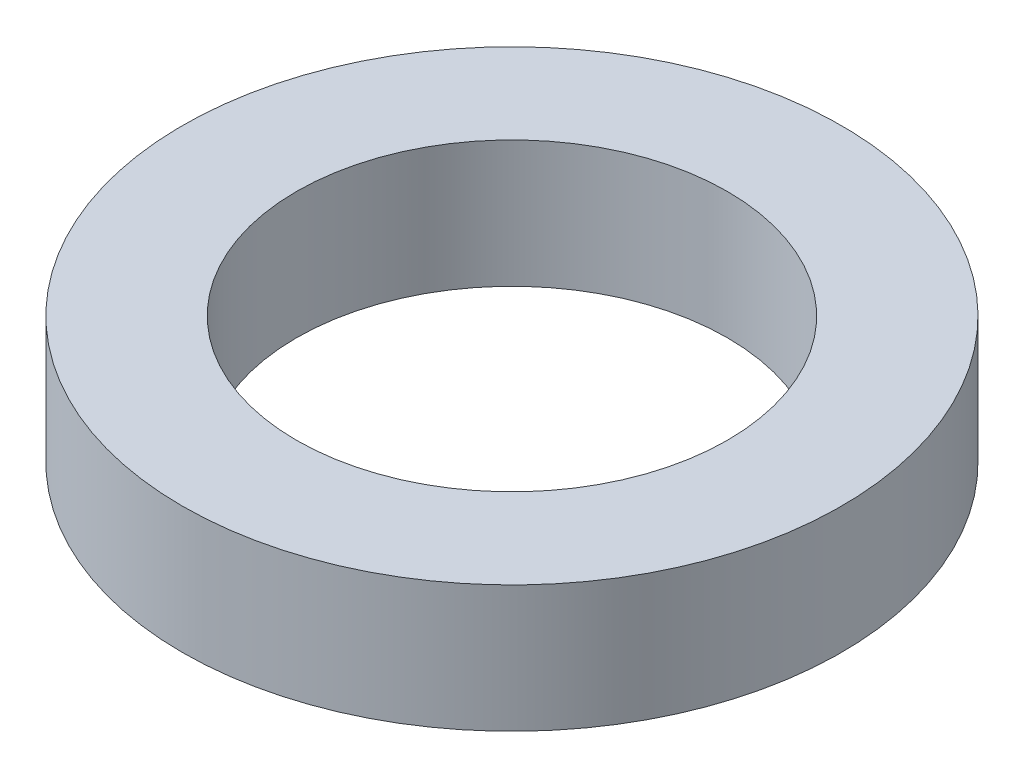
ISO-10303-21;
HEADER;
FILE_DESCRIPTION(('STEP AP214'),'2;1');
FILE_NAME('part.step','',(''),(''),'','','');
FILE_SCHEMA(('AUTOMOTIVE_DESIGN { 1 0 10303 214 1 1 1 1 }'));
ENDSEC;
DATA;
#1=APPLICATION_CONTEXT('core data for automotive mechanical design processes');
#2=APPLICATION_PROTOCOL_DEFINITION('international standard','automotive_design',2000,#1);
#3=PRODUCT_CONTEXT('',#1,'mechanical');
#4=PRODUCT('Part','Part','',(#3));
#5=PRODUCT_RELATED_PRODUCT_CATEGORY('part','',(#4));
#6=PRODUCT_DEFINITION_FORMATION('','',#4);
#7=PRODUCT_DEFINITION_CONTEXT('part definition',#1,'design');
#8=PRODUCT_DEFINITION('design','',#6,#7);
#9=PRODUCT_DEFINITION_SHAPE('','',#8);
#10=(LENGTH_UNIT() NAMED_UNIT(*) SI_UNIT(.MILLI.,.METRE.));
#11=(NAMED_UNIT(*) PLANE_ANGLE_UNIT() SI_UNIT($,.RADIAN.));
#12=(NAMED_UNIT(*) SI_UNIT($,.STERADIAN.) SOLID_ANGLE_UNIT());
#13=UNCERTAINTY_MEASURE_WITH_UNIT(LENGTH_MEASURE(1.E-05),#10,'distance_accuracy_value','');
#14=(GEOMETRIC_REPRESENTATION_CONTEXT(3) GLOBAL_UNCERTAINTY_ASSIGNED_CONTEXT((#13)) GLOBAL_UNIT_ASSIGNED_CONTEXT((#10,
#11,#12)) REPRESENTATION_CONTEXT('',''));
#15=CARTESIAN_POINT('',(0.,0.,0.));
#16=DIRECTION('',(0.,0.,1.));
#17=DIRECTION('',(1.,0.,0.));
#18=AXIS2_PLACEMENT_3D('',#15,#16,#17);
#19=CARTESIAN_POINT('',(0.,5.,0.));
#20=DIRECTION('',(0.,1.,0.));
#21=DIRECTION('',(0.,0.,1.));
#22=AXIS2_PLACEMENT_3D('',#19,#20,#21);
#23=PLANE('',#22);
#24=CARTESIAN_POINT('',(0.,5.,0.));
#25=DIRECTION('',(0.,1.,0.));
#26=DIRECTION('',(0.,0.,1.));
#27=AXIS2_PLACEMENT_3D('',#24,#25,#26);
#28=CIRCLE('',#27,13.);
#29=CARTESIAN_POINT('',(0.,5.,13.));
#30=VERTEX_POINT('',#29);
#31=EDGE_CURVE('E10',#30,#30,#28,.T.);
#32=ORIENTED_EDGE('',*,*,#31,.T.);
#33=EDGE_LOOP('',(#32));
#34=FACE_BOUND('',#33,.T.);
#35=CARTESIAN_POINT('',(0.,5.,0.));
#36=DIRECTION('',(0.,1.,0.));
#37=DIRECTION('',(0.,0.,1.));
#38=AXIS2_PLACEMENT_3D('',#35,#36,#37);
#39=CIRCLE('',#38,8.5);
#40=CARTESIAN_POINT('',(0.,5.,8.5));
#41=VERTEX_POINT('',#40);
#42=EDGE_CURVE('E43',#41,#41,#39,.T.);
#43=ORIENTED_EDGE('',*,*,#42,.F.);
#44=EDGE_LOOP('',(#43));
#45=FACE_BOUND('',#44,.T.);
#46=ADVANCED_FACE('F32',(#34,#45),#23,.T.);
#47=CARTESIAN_POINT('',(0.,0.,0.));
#48=DIRECTION('',(0.,1.,0.));
#49=DIRECTION('',(0.,0.,1.));
#50=AXIS2_PLACEMENT_3D('',#47,#48,#49);
#51=PLANE('',#50);
#52=CARTESIAN_POINT('',(0.,0.,0.));
#53=DIRECTION('',(0.,1.,0.));
#54=DIRECTION('',(0.,0.,1.));
#55=AXIS2_PLACEMENT_3D('',#52,#53,#54);
#56=CIRCLE('',#55,13.);
#57=CARTESIAN_POINT('',(0.,0.,13.));
#58=VERTEX_POINT('',#57);
#59=EDGE_CURVE('E36',#58,#58,#56,.T.);
#60=ORIENTED_EDGE('',*,*,#59,.F.);
#61=EDGE_LOOP('',(#60));
#62=FACE_BOUND('',#61,.T.);
#63=CARTESIAN_POINT('',(0.,0.,0.));
#64=DIRECTION('',(0.,1.,0.));
#65=DIRECTION('',(0.,0.,1.));
#66=AXIS2_PLACEMENT_3D('',#63,#64,#65);
#67=CIRCLE('',#66,8.5);
#68=CARTESIAN_POINT('',(0.,0.,8.5));
#69=VERTEX_POINT('',#68);
#70=EDGE_CURVE('E45',#69,#69,#67,.T.);
#71=ORIENTED_EDGE('',*,*,#70,.T.);
#72=EDGE_LOOP('',(#71));
#73=FACE_BOUND('',#72,.T.);
#74=ADVANCED_FACE('F55',(#62,#73),#51,.F.);
#75=CARTESIAN_POINT('',(0.,5.,0.));
#76=DIRECTION('',(0.,-1.,0.));
#77=DIRECTION('',(0.,0.,-1.));
#78=AXIS2_PLACEMENT_3D('',#75,#76,#77);
#79=CYLINDRICAL_SURFACE('',#78,13.);
#80=ORIENTED_EDGE('',*,*,#31,.F.);
#81=EDGE_LOOP('',(#80));
#82=FACE_BOUND('',#81,.T.);
#83=ORIENTED_EDGE('',*,*,#59,.T.);
#84=EDGE_LOOP('',(#83));
#85=FACE_BOUND('',#84,.T.);
#86=ADVANCED_FACE('F34',(#82,#85),#79,.T.);
#87=CARTESIAN_POINT('',(0.,5.,0.));
#88=DIRECTION('',(0.,-1.,0.));
#89=DIRECTION('',(0.,0.,-1.));
#90=AXIS2_PLACEMENT_3D('',#87,#88,#89);
#91=CYLINDRICAL_SURFACE('',#90,8.5);
#92=ORIENTED_EDGE('',*,*,#42,.T.);
#93=EDGE_LOOP('',(#92));
#94=FACE_BOUND('',#93,.T.);
#95=ORIENTED_EDGE('',*,*,#70,.F.);
#96=EDGE_LOOP('',(#95));
#97=FACE_BOUND('',#96,.T.);
#98=ADVANCED_FACE('F51',(#94,#97),#91,.F.);
#99=CLOSED_SHELL('',(#46,#74,#86,#98));
#100=MANIFOLD_SOLID_BREP('B2',#99);
#101=ADVANCED_BREP_SHAPE_REPRESENTATION('',(#18,#100),#14);
#102=SHAPE_DEFINITION_REPRESENTATION(#9,#101);
ENDSEC;
END-ISO-10303-21;
